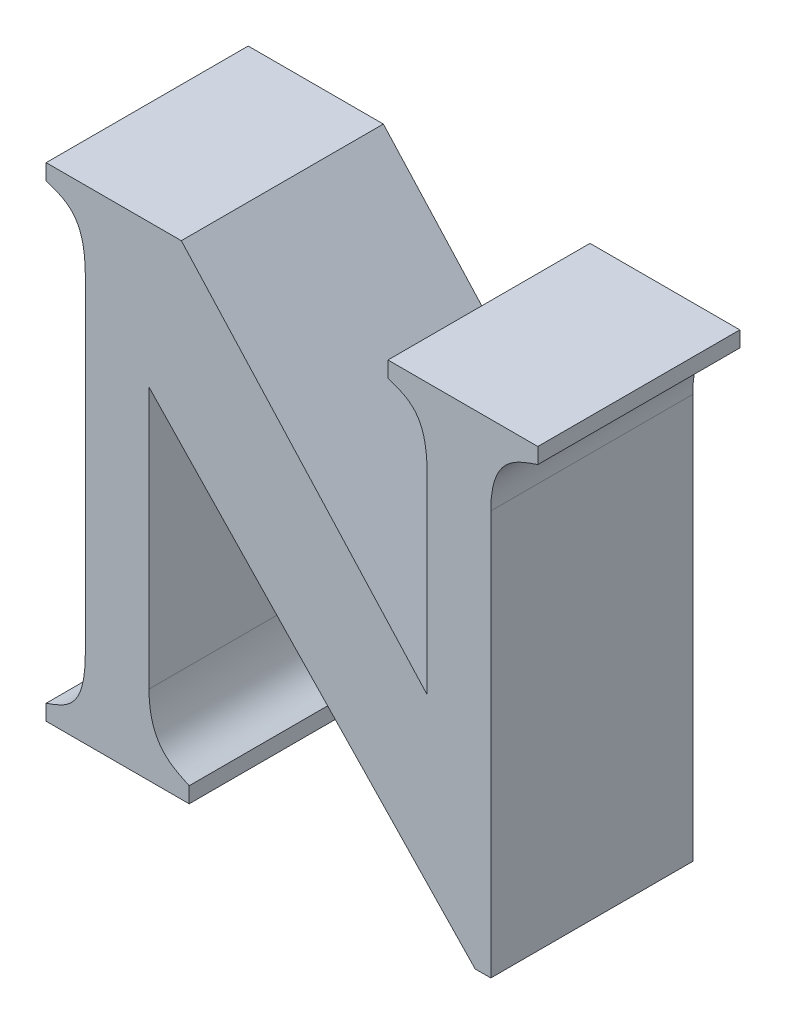
ISO-10303-21;
HEADER;
FILE_DESCRIPTION(('STEP AP214'),'2;1');
FILE_NAME('part.step','',(''),(''),'','','');
FILE_SCHEMA(('AUTOMOTIVE_DESIGN { 1 0 10303 214 1 1 1 1 }'));
ENDSEC;
DATA;
#1=APPLICATION_CONTEXT('core data for automotive mechanical design processes');
#2=APPLICATION_PROTOCOL_DEFINITION('international standard','automotive_design',2000,#1);
#3=PRODUCT_CONTEXT('',#1,'mechanical');
#4=PRODUCT('Part','Part','',(#3));
#5=PRODUCT_RELATED_PRODUCT_CATEGORY('part','',(#4));
#6=PRODUCT_DEFINITION_FORMATION('','',#4);
#7=PRODUCT_DEFINITION_CONTEXT('part definition',#1,'design');
#8=PRODUCT_DEFINITION('design','',#6,#7);
#9=PRODUCT_DEFINITION_SHAPE('','',#8);
#10=(LENGTH_UNIT() NAMED_UNIT(*) SI_UNIT(.MILLI.,.METRE.));
#11=(NAMED_UNIT(*) PLANE_ANGLE_UNIT() SI_UNIT($,.RADIAN.));
#12=(NAMED_UNIT(*) SI_UNIT($,.STERADIAN.) SOLID_ANGLE_UNIT());
#13=UNCERTAINTY_MEASURE_WITH_UNIT(LENGTH_MEASURE(1.E-05),#10,'distance_accuracy_value','');
#14=(GEOMETRIC_REPRESENTATION_CONTEXT(3) GLOBAL_UNCERTAINTY_ASSIGNED_CONTEXT((#13)) GLOBAL_UNIT_ASSIGNED_CONTEXT((#10,
#11,#12)) REPRESENTATION_CONTEXT('',''));
#15=CARTESIAN_POINT('',(0.,0.,0.));
#16=DIRECTION('',(0.,0.,1.));
#17=DIRECTION('',(1.,0.,0.));
#18=AXIS2_PLACEMENT_3D('',#15,#16,#17);
#19=CARTESIAN_POINT('',(2.5314200484986,-0.432050714249068,0.));
#20=DIRECTION('',(1.,0.,0.));
#21=DIRECTION('',(0.,1.,0.));
#22=AXIS2_PLACEMENT_3D('',#19,#20,#21);
#23=PLANE('',#22);
#24=DIRECTION('',(0.,-1.,0.));
#25=VECTOR('',#24,1.);
#26=CARTESIAN_POINT('',(2.5314200484986,-0.231839582517053,0.));
#27=LINE('',#26,#25);
#28=CARTESIAN_POINT('',(2.5314200484986,-0.231839582517053,0.));
#29=VERTEX_POINT('',#28);
#30=CARTESIAN_POINT('',(2.5314200484986,-0.432050714249068,0.));
#31=VERTEX_POINT('',#30);
#32=EDGE_CURVE('E11',#29,#31,#27,.T.);
#33=ORIENTED_EDGE('',*,*,#32,.F.);
#34=DIRECTION('',(0.,0.,1.));
#35=VECTOR('',#34,1.);
#36=CARTESIAN_POINT('',(2.5314200484986,-0.231839582517053,0.));
#37=LINE('',#36,#35);
#38=CARTESIAN_POINT('',(2.5314200484986,-0.231839582517053,0.1));
#39=VERTEX_POINT('',#38);
#40=EDGE_CURVE('E24',#29,#39,#37,.T.);
#41=ORIENTED_EDGE('',*,*,#40,.T.);
#42=DIRECTION('',(0.,1.,0.));
#43=VECTOR('',#42,1.);
#44=CARTESIAN_POINT('',(2.5314200484986,-0.231839582517053,0.1));
#45=LINE('',#44,#43);
#46=CARTESIAN_POINT('',(2.5314200484986,-0.432050714249068,0.1));
#47=VERTEX_POINT('',#46);
#48=EDGE_CURVE('E172',#47,#39,#45,.T.);
#49=ORIENTED_EDGE('',*,*,#48,.F.);
#50=DIRECTION('',(0.,0.,1.));
#51=VECTOR('',#50,1.);
#52=CARTESIAN_POINT('',(2.5314200484986,-0.432050714249068,0.));
#53=LINE('',#52,#51);
#54=EDGE_CURVE('E359',#31,#47,#53,.T.);
#55=ORIENTED_EDGE('',*,*,#54,.F.);
#56=EDGE_LOOP('',(#33,#41,#49,#55));
#57=FACE_BOUND('',#56,.T.);
#58=ADVANCED_FACE('F17',(#57),#23,.T.);
#59=CARTESIAN_POINT('',(2.5236639057569,-0.432050714249068,0.));
#60=DIRECTION('',(0.,-1.,0.));
#61=DIRECTION('',(1.,0.,0.));
#62=AXIS2_PLACEMENT_3D('',#59,#60,#61);
#63=PLANE('',#62);
#64=DIRECTION('',(-1.,0.,0.));
#65=VECTOR('',#64,1.);
#66=CARTESIAN_POINT('',(2.5314200484986,-0.432050714249068,0.));
#67=LINE('',#66,#65);
#68=CARTESIAN_POINT('',(2.5236639057569,-0.432050714249068,0.));
#69=VERTEX_POINT('',#68);
#70=EDGE_CURVE('E357',#31,#69,#67,.T.);
#71=ORIENTED_EDGE('',*,*,#70,.F.);
#72=ORIENTED_EDGE('',*,*,#54,.T.);
#73=DIRECTION('',(1.,0.,0.));
#74=VECTOR('',#73,1.);
#75=CARTESIAN_POINT('',(2.5314200484986,-0.432050714249068,0.1));
#76=LINE('',#75,#74);
#77=CARTESIAN_POINT('',(2.5236639057569,-0.432050714249068,0.1));
#78=VERTEX_POINT('',#77);
#79=EDGE_CURVE('E355',#78,#47,#76,.T.);
#80=ORIENTED_EDGE('',*,*,#79,.F.);
#81=DIRECTION('',(0.,0.,1.));
#82=VECTOR('',#81,1.);
#83=CARTESIAN_POINT('',(2.5236639057569,-0.432050714249068,0.));
#84=LINE('',#83,#82);
#85=EDGE_CURVE('E352',#69,#78,#84,.T.);
#86=ORIENTED_EDGE('',*,*,#85,.F.);
#87=EDGE_LOOP('',(#71,#72,#80,#86));
#88=FACE_BOUND('',#87,.T.);
#89=ADVANCED_FACE('F429',(#88),#63,.T.);
#90=CARTESIAN_POINT('',(2.3622340281803,-0.263349763608539,0.));
#91=DIRECTION('',(-0.722505463033563,-0.691365211654923,0.));
#92=DIRECTION('',(0.691365211654923,-0.722505463033563,0.));
#93=AXIS2_PLACEMENT_3D('',#90,#91,#92);
#94=PLANE('',#93);
#95=DIRECTION('',(-0.691365211654923,0.722505463033563,0.));
#96=VECTOR('',#95,1.);
#97=CARTESIAN_POINT('',(2.5236639057569,-0.432050714249068,0.));
#98=LINE('',#97,#96);
#99=CARTESIAN_POINT('',(2.3622340281803,-0.263349763608539,0.));
#100=VERTEX_POINT('',#99);
#101=EDGE_CURVE('E350',#69,#100,#98,.T.);
#102=ORIENTED_EDGE('',*,*,#101,.F.);
#103=ORIENTED_EDGE('',*,*,#85,.T.);
#104=DIRECTION('',(0.691365211654923,-0.722505463033563,0.));
#105=VECTOR('',#104,1.);
#106=CARTESIAN_POINT('',(2.5236639057569,-0.432050714249068,0.1));
#107=LINE('',#106,#105);
#108=CARTESIAN_POINT('',(2.3622340281803,-0.263349763608539,0.1));
#109=VERTEX_POINT('',#108);
#110=EDGE_CURVE('E347',#109,#78,#107,.T.);
#111=ORIENTED_EDGE('',*,*,#110,.F.);
#112=DIRECTION('',(0.,0.,1.));
#113=VECTOR('',#112,1.);
#114=CARTESIAN_POINT('',(2.3622340281803,-0.263349763608539,0.));
#115=LINE('',#114,#113);
#116=EDGE_CURVE('E344',#100,#109,#115,.T.);
#117=ORIENTED_EDGE('',*,*,#116,.F.);
#118=EDGE_LOOP('',(#102,#103,#111,#117));
#119=FACE_BOUND('',#118,.T.);
#120=ADVANCED_FACE('F425',(#119),#94,.T.);
#121=CARTESIAN_POINT('',(2.3622340281803,-0.392784138206144,0.));
#122=DIRECTION('',(1.,0.,0.));
#123=DIRECTION('',(0.,1.,0.));
#124=AXIS2_PLACEMENT_3D('',#121,#122,#123);
#125=PLANE('',#124);
#126=DIRECTION('',(0.,-1.,0.));
#127=VECTOR('',#126,1.);
#128=CARTESIAN_POINT('',(2.3622340281803,-0.263349763608539,0.));
#129=LINE('',#128,#127);
#130=CARTESIAN_POINT('',(2.3622340281803,-0.392784138206144,0.));
#131=VERTEX_POINT('',#130);
#132=EDGE_CURVE('E342',#100,#131,#129,.T.);
#133=ORIENTED_EDGE('',*,*,#132,.F.);
#134=ORIENTED_EDGE('',*,*,#116,.T.);
#135=DIRECTION('',(0.,1.,0.));
#136=VECTOR('',#135,1.);
#137=CARTESIAN_POINT('',(2.3622340281803,-0.263349763608539,0.1));
#138=LINE('',#137,#136);
#139=CARTESIAN_POINT('',(2.3622340281803,-0.392784138206144,0.1));
#140=VERTEX_POINT('',#139);
#141=EDGE_CURVE('E339',#140,#109,#138,.T.);
#142=ORIENTED_EDGE('',*,*,#141,.F.);
#143=DIRECTION('',(0.,0.,1.));
#144=VECTOR('',#143,1.);
#145=CARTESIAN_POINT('',(2.3622340281803,-0.392784138206144,0.));
#146=LINE('',#145,#144);
#147=EDGE_CURVE('E333',#131,#140,#146,.T.);
#148=ORIENTED_EDGE('',*,*,#147,.F.);
#149=EDGE_LOOP('',(#133,#134,#142,#148));
#150=FACE_BOUND('',#149,.T.);
#151=ADVANCED_FACE('F421',(#150),#125,.T.);
#152=CARTESIAN_POINT('',(2.3821106076673,-0.424294319298148,0.));
#153=CARTESIAN_POINT('',(2.3821106076673,-0.424294319298148,0.1));
#154=CARTESIAN_POINT('',(2.3743544641725,-0.420416068108024,0.));
#155=CARTESIAN_POINT('',(2.3743544641725,-0.420416068108024,0.1));
#156=CARTESIAN_POINT('',(2.3622340275333,-0.416537924348325,0.));
#157=CARTESIAN_POINT('',(2.3622340275333,-0.416537924348325,0.1));
#158=CARTESIAN_POINT('',(2.3622340281803,-0.392784138206144,0.));
#159=CARTESIAN_POINT('',(2.3622340281803,-0.392784138206144,0.1));
#160=B_SPLINE_SURFACE_WITH_KNOTS('',3,1,((#152,#153),(#154,#155),(#156,#157),(#158,#159)),
.UNSPECIFIED.,.F.,.F.,.F.,(4,4),(2,2),(-1.,0.),(0.,0.01),.UNSPECIFIED.);
#161=CARTESIAN_POINT('',(2.3622340281803,-0.392784138206144,0.));
#162=CARTESIAN_POINT('',(2.3622340275333,-0.416537924348325,0.));
#163=CARTESIAN_POINT('',(2.3743544641725,-0.420416068108024,0.));
#164=CARTESIAN_POINT('',(2.3821106076673,-0.424294319298148,0.));
#165=B_SPLINE_CURVE_WITH_KNOTS('',3,(#161,#162,#163,#164),.UNSPECIFIED.,.F.,.F.,(4,4),(0.,1.),.UNSPECIFIED.);
#166=CARTESIAN_POINT('',(2.3821106076673,-0.424294319298148,0.));
#167=VERTEX_POINT('',#166);
#168=EDGE_CURVE('E326',#131,#167,#165,.T.);
#169=CARTESIAN_POINT('',(2.3821106076673,-0.424294319298148,0.1));
#170=CARTESIAN_POINT('',(2.3743544641725,-0.420416068108024,0.1));
#171=CARTESIAN_POINT('',(2.3622340275333,-0.416537924348325,0.1));
#172=CARTESIAN_POINT('',(2.3622340281803,-0.392784138206144,0.1));
#173=B_SPLINE_CURVE_WITH_KNOTS('',3,(#169,#170,#171,#172),.UNSPECIFIED.,.F.,.F.,(4,4),(-1.,0.),.UNSPECIFIED.);
#174=CARTESIAN_POINT('',(2.3821106076673,-0.424294319298148,0.1));
#175=VERTEX_POINT('',#174);
#176=EDGE_CURVE('E321',#175,#140,#173,.T.);
#177=DIRECTION('',(0.,0.,1.));
#178=VECTOR('',#177,1.);
#179=CARTESIAN_POINT('',(2.3821106076673,-0.424294319298148,0.));
#180=LINE('',#179,#178);
#181=EDGE_CURVE('E318',#167,#175,#180,.T.);
#182=ORIENTED_EDGE('',*,*,#168,.F.);
#183=ORIENTED_EDGE('',*,*,#147,.T.);
#184=ORIENTED_EDGE('',*,*,#176,.F.);
#185=ORIENTED_EDGE('',*,*,#181,.F.);
#186=EDGE_LOOP('',(#182,#183,#184,#185));
#187=FACE_BOUND('',#186,.T.);
#188=ADVANCED_FACE('F417',(#187),#160,.T.);
#189=CARTESIAN_POINT('',(2.3821106076673,-0.432050714249068,0.));
#190=DIRECTION('',(1.,0.,0.));
#191=DIRECTION('',(0.,1.,0.));
#192=AXIS2_PLACEMENT_3D('',#189,#190,#191);
#193=PLANE('',#192);
#194=DIRECTION('',(0.,-1.,0.));
#195=VECTOR('',#194,1.);
#196=CARTESIAN_POINT('',(2.3821106076673,-0.424294319298148,0.));
#197=LINE('',#196,#195);
#198=CARTESIAN_POINT('',(2.3821106076673,-0.432050714249068,0.));
#199=VERTEX_POINT('',#198);
#200=EDGE_CURVE('E316',#167,#199,#197,.T.);
#201=ORIENTED_EDGE('',*,*,#200,.F.);
#202=ORIENTED_EDGE('',*,*,#181,.T.);
#203=DIRECTION('',(0.,1.,0.));
#204=VECTOR('',#203,1.);
#205=CARTESIAN_POINT('',(2.3821106076673,-0.424294319298148,0.1));
#206=LINE('',#205,#204);
#207=CARTESIAN_POINT('',(2.3821106076673,-0.432050714249068,0.1));
#208=VERTEX_POINT('',#207);
#209=EDGE_CURVE('E313',#208,#175,#206,.T.);
#210=ORIENTED_EDGE('',*,*,#209,.F.);
#211=DIRECTION('',(0.,0.,1.));
#212=VECTOR('',#211,1.);
#213=CARTESIAN_POINT('',(2.3821106076673,-0.432050714249068,0.));
#214=LINE('',#213,#212);
#215=EDGE_CURVE('E310',#199,#208,#214,.T.);
#216=ORIENTED_EDGE('',*,*,#215,.F.);
#217=EDGE_LOOP('',(#201,#202,#210,#216));
#218=FACE_BOUND('',#217,.T.);
#219=ADVANCED_FACE('F413',(#218),#193,.T.);
#220=CARTESIAN_POINT('',(2.311332517429,-0.432050714249068,0.));
#221=DIRECTION('',(0.,-1.,0.));
#222=DIRECTION('',(1.,0.,0.));
#223=AXIS2_PLACEMENT_3D('',#220,#221,#222);
#224=PLANE('',#223);
#225=DIRECTION('',(-1.,0.,0.));
#226=VECTOR('',#225,1.);
#227=CARTESIAN_POINT('',(2.3821106076673,-0.432050714249068,0.));
#228=LINE('',#227,#226);
#229=CARTESIAN_POINT('',(2.311332517429,-0.432050714249068,0.));
#230=VERTEX_POINT('',#229);
#231=EDGE_CURVE('E308',#199,#230,#228,.T.);
#232=ORIENTED_EDGE('',*,*,#231,.F.);
#233=ORIENTED_EDGE('',*,*,#215,.T.);
#234=DIRECTION('',(1.,0.,0.));
#235=VECTOR('',#234,1.);
#236=CARTESIAN_POINT('',(2.3821106076673,-0.432050714249068,0.1));
#237=LINE('',#236,#235);
#238=CARTESIAN_POINT('',(2.311332517429,-0.432050714249068,0.1));
#239=VERTEX_POINT('',#238);
#240=EDGE_CURVE('E305',#239,#208,#237,.T.);
#241=ORIENTED_EDGE('',*,*,#240,.F.);
#242=DIRECTION('',(0.,0.,1.));
#243=VECTOR('',#242,1.);
#244=CARTESIAN_POINT('',(2.311332517429,-0.432050714249068,0.));
#245=LINE('',#244,#243);
#246=EDGE_CURVE('E302',#230,#239,#245,.T.);
#247=ORIENTED_EDGE('',*,*,#246,.F.);
#248=EDGE_LOOP('',(#232,#233,#241,#247));
#249=FACE_BOUND('',#248,.T.);
#250=ADVANCED_FACE('F409',(#249),#224,.T.);
#251=CARTESIAN_POINT('',(2.311332517429,-0.424294319298148,0.));
#252=DIRECTION('',(-1.,0.,0.));
#253=DIRECTION('',(0.,-1.,0.));
#254=AXIS2_PLACEMENT_3D('',#251,#252,#253);
#255=PLANE('',#254);
#256=DIRECTION('',(0.,1.,0.));
#257=VECTOR('',#256,1.);
#258=CARTESIAN_POINT('',(2.311332517429,-0.432050714249068,0.));
#259=LINE('',#258,#257);
#260=CARTESIAN_POINT('',(2.311332517429,-0.424294319298148,0.));
#261=VERTEX_POINT('',#260);
#262=EDGE_CURVE('E300',#230,#261,#259,.T.);
#263=ORIENTED_EDGE('',*,*,#262,.F.);
#264=ORIENTED_EDGE('',*,*,#246,.T.);
#265=DIRECTION('',(0.,-1.,0.));
#266=VECTOR('',#265,1.);
#267=CARTESIAN_POINT('',(2.311332517429,-0.432050714249068,0.1));
#268=LINE('',#267,#266);
#269=CARTESIAN_POINT('',(2.311332517429,-0.424294319298148,0.1));
#270=VERTEX_POINT('',#269);
#271=EDGE_CURVE('E297',#270,#239,#268,.T.);
#272=ORIENTED_EDGE('',*,*,#271,.F.);
#273=DIRECTION('',(0.,0.,1.));
#274=VECTOR('',#273,1.);
#275=CARTESIAN_POINT('',(2.311332517429,-0.424294319298148,0.));
#276=LINE('',#275,#274);
#277=EDGE_CURVE('E291',#261,#270,#276,.T.);
#278=ORIENTED_EDGE('',*,*,#277,.F.);
#279=EDGE_LOOP('',(#263,#264,#272,#278));
#280=FACE_BOUND('',#279,.T.);
#281=ADVANCED_FACE('F405',(#280),#255,.T.);
#282=CARTESIAN_POINT('',(2.330723775029,-0.392784138206144,0.));
#283=CARTESIAN_POINT('',(2.330723775029,-0.392784138206144,0.1));
#284=CARTESIAN_POINT('',(2.3307237748656,-0.416537923939684,0.));
#285=CARTESIAN_POINT('',(2.3307237748656,-0.416537923939684,0.1));
#286=CARTESIAN_POINT('',(2.3229676322059,-0.420416067532685,0.));
#287=CARTESIAN_POINT('',(2.3229676322059,-0.420416067532685,0.1));
#288=CARTESIAN_POINT('',(2.311332517429,-0.424294319298148,0.));
#289=CARTESIAN_POINT('',(2.311332517429,-0.424294319298148,0.1));
#290=B_SPLINE_SURFACE_WITH_KNOTS('',3,1,((#282,#283),(#284,#285),(#286,#287),(#288,#289)),
.UNSPECIFIED.,.F.,.F.,.F.,(4,4),(2,2),(-1.,0.),(0.,0.01),.UNSPECIFIED.);
#291=CARTESIAN_POINT('',(2.311332517429,-0.424294319298148,0.));
#292=CARTESIAN_POINT('',(2.3229676322059,-0.420416067532685,0.));
#293=CARTESIAN_POINT('',(2.3307237748656,-0.416537923939684,0.));
#294=CARTESIAN_POINT('',(2.330723775029,-0.392784138206144,0.));
#295=B_SPLINE_CURVE_WITH_KNOTS('',3,(#291,#292,#293,#294),.UNSPECIFIED.,.F.,.F.,(4,4),(0.,1.),.UNSPECIFIED.);
#296=CARTESIAN_POINT('',(2.330723775029,-0.392784138206144,0.));
#297=VERTEX_POINT('',#296);
#298=EDGE_CURVE('E284',#261,#297,#295,.T.);
#299=CARTESIAN_POINT('',(2.330723775029,-0.392784138206144,0.1));
#300=CARTESIAN_POINT('',(2.3307237748656,-0.416537923939684,0.1));
#301=CARTESIAN_POINT('',(2.3229676322059,-0.420416067532685,0.1));
#302=CARTESIAN_POINT('',(2.311332517429,-0.424294319298148,0.1));
#303=B_SPLINE_CURVE_WITH_KNOTS('',3,(#299,#300,#301,#302),.UNSPECIFIED.,.F.,.F.,(4,4),(-1.,0.),.UNSPECIFIED.);
#304=CARTESIAN_POINT('',(2.330723775029,-0.392784138206144,0.1));
#305=VERTEX_POINT('',#304);
#306=EDGE_CURVE('E279',#305,#270,#303,.T.);
#307=DIRECTION('',(0.,0.,1.));
#308=VECTOR('',#307,1.);
#309=CARTESIAN_POINT('',(2.330723775029,-0.392784138206144,0.));
#310=LINE('',#309,#308);
#311=EDGE_CURVE('E276',#297,#305,#310,.T.);
#312=ORIENTED_EDGE('',*,*,#298,.F.);
#313=ORIENTED_EDGE('',*,*,#277,.T.);
#314=ORIENTED_EDGE('',*,*,#306,.F.);
#315=ORIENTED_EDGE('',*,*,#311,.F.);
#316=EDGE_LOOP('',(#312,#313,#314,#315));
#317=FACE_BOUND('',#316,.T.);
#318=ADVANCED_FACE('F401',(#317),#290,.T.);
#319=CARTESIAN_POINT('',(2.330723775029,-0.231839582517053,0.));
#320=DIRECTION('',(-1.,0.,0.));
#321=DIRECTION('',(0.,-1.,0.));
#322=AXIS2_PLACEMENT_3D('',#319,#320,#321);
#323=PLANE('',#322);
#324=DIRECTION('',(0.,1.,0.));
#325=VECTOR('',#324,1.);
#326=CARTESIAN_POINT('',(2.330723775029,-0.392784138206144,0.));
#327=LINE('',#326,#325);
#328=CARTESIAN_POINT('',(2.330723775029,-0.231839582517053,0.));
#329=VERTEX_POINT('',#328);
#330=EDGE_CURVE('E274',#297,#329,#327,.T.);
#331=ORIENTED_EDGE('',*,*,#330,.F.);
#332=ORIENTED_EDGE('',*,*,#311,.T.);
#333=DIRECTION('',(0.,-1.,0.));
#334=VECTOR('',#333,1.);
#335=CARTESIAN_POINT('',(2.330723775029,-0.392784138206144,0.1));
#336=LINE('',#335,#334);
#337=CARTESIAN_POINT('',(2.330723775029,-0.231839582517053,0.1));
#338=VERTEX_POINT('',#337);
#339=EDGE_CURVE('E271',#338,#305,#336,.T.);
#340=ORIENTED_EDGE('',*,*,#339,.F.);
#341=DIRECTION('',(0.,0.,1.));
#342=VECTOR('',#341,1.);
#343=CARTESIAN_POINT('',(2.330723775029,-0.231839582517053,0.));
#344=LINE('',#343,#342);
#345=EDGE_CURVE('E265',#329,#338,#344,.T.);
#346=ORIENTED_EDGE('',*,*,#345,.F.);
#347=EDGE_LOOP('',(#331,#332,#340,#346));
#348=FACE_BOUND('',#347,.T.);
#349=ADVANCED_FACE('F397',(#348),#323,.T.);
#350=CARTESIAN_POINT('',(2.311332517429,-0.200329401425036,0.));
#351=CARTESIAN_POINT('',(2.311332517429,-0.200329401425036,0.1));
#352=CARTESIAN_POINT('',(2.3229676322875,-0.204207508825576,0.));
#353=CARTESIAN_POINT('',(2.3229676322875,-0.204207508825576,0.1));
#354=CARTESIAN_POINT('',(2.3307237750288,-0.2080857603454,0.));
#355=CARTESIAN_POINT('',(2.3307237750288,-0.2080857603454,0.1));
#356=CARTESIAN_POINT('',(2.330723775029,-0.231839582517053,0.));
#357=CARTESIAN_POINT('',(2.330723775029,-0.231839582517053,0.1));
#358=B_SPLINE_SURFACE_WITH_KNOTS('',3,1,((#350,#351),(#352,#353),(#354,#355),(#356,#357)),
.UNSPECIFIED.,.F.,.F.,.F.,(4,4),(2,2),(-1.,0.),(0.,0.01),.UNSPECIFIED.);
#359=CARTESIAN_POINT('',(2.330723775029,-0.231839582517053,0.));
#360=CARTESIAN_POINT('',(2.3307237750288,-0.2080857603454,0.));
#361=CARTESIAN_POINT('',(2.3229676322875,-0.204207508825576,0.));
#362=CARTESIAN_POINT('',(2.311332517429,-0.200329401425036,0.));
#363=B_SPLINE_CURVE_WITH_KNOTS('',3,(#359,#360,#361,#362),.UNSPECIFIED.,.F.,.F.,(4,4),(0.,1.),.UNSPECIFIED.);
#364=CARTESIAN_POINT('',(2.311332517429,-0.200329401425036,0.));
#365=VERTEX_POINT('',#364);
#366=EDGE_CURVE('E258',#329,#365,#363,.T.);
#367=CARTESIAN_POINT('',(2.311332517429,-0.200329401425036,0.1));
#368=CARTESIAN_POINT('',(2.3229676322875,-0.204207508825576,0.1));
#369=CARTESIAN_POINT('',(2.3307237750288,-0.2080857603454,0.1));
#370=CARTESIAN_POINT('',(2.330723775029,-0.231839582517053,0.1));
#371=B_SPLINE_CURVE_WITH_KNOTS('',3,(#367,#368,#369,#370),.UNSPECIFIED.,.F.,.F.,(4,4),(-1.,0.),.UNSPECIFIED.);
#372=CARTESIAN_POINT('',(2.311332517429,-0.200329401425036,0.1));
#373=VERTEX_POINT('',#372);
#374=EDGE_CURVE('E253',#373,#338,#371,.T.);
#375=DIRECTION('',(0.,0.,1.));
#376=VECTOR('',#375,1.);
#377=CARTESIAN_POINT('',(2.311332517429,-0.200329401425036,0.));
#378=LINE('',#377,#376);
#379=EDGE_CURVE('E250',#365,#373,#378,.T.);
#380=ORIENTED_EDGE('',*,*,#366,.F.);
#381=ORIENTED_EDGE('',*,*,#345,.T.);
#382=ORIENTED_EDGE('',*,*,#374,.F.);
#383=ORIENTED_EDGE('',*,*,#379,.F.);
#384=EDGE_LOOP('',(#380,#381,#382,#383));
#385=FACE_BOUND('',#384,.T.);
#386=ADVANCED_FACE('F393',(#385),#358,.T.);
#387=CARTESIAN_POINT('',(2.311332517429,-0.19257300647474,0.));
#388=DIRECTION('',(-1.,0.,0.));
#389=DIRECTION('',(0.,-1.,0.));
#390=AXIS2_PLACEMENT_3D('',#387,#388,#389);
#391=PLANE('',#390);
#392=DIRECTION('',(0.,1.,0.));
#393=VECTOR('',#392,1.);
#394=CARTESIAN_POINT('',(2.311332517429,-0.200329401425036,0.));
#395=LINE('',#394,#393);
#396=CARTESIAN_POINT('',(2.311332517429,-0.19257300647474,0.));
#397=VERTEX_POINT('',#396);
#398=EDGE_CURVE('E248',#365,#397,#395,.T.);
#399=ORIENTED_EDGE('',*,*,#398,.F.);
#400=ORIENTED_EDGE('',*,*,#379,.T.);
#401=DIRECTION('',(0.,-1.,0.));
#402=VECTOR('',#401,1.);
#403=CARTESIAN_POINT('',(2.311332517429,-0.200329401425036,0.1));
#404=LINE('',#403,#402);
#405=CARTESIAN_POINT('',(2.311332517429,-0.19257300647474,0.1));
#406=VERTEX_POINT('',#405);
#407=EDGE_CURVE('E245',#406,#373,#404,.T.);
#408=ORIENTED_EDGE('',*,*,#407,.F.);
#409=DIRECTION('',(0.,0.,1.));
#410=VECTOR('',#409,1.);
#411=CARTESIAN_POINT('',(2.311332517429,-0.19257300647474,0.));
#412=LINE('',#411,#410);
#413=EDGE_CURVE('E242',#397,#406,#412,.T.);
#414=ORIENTED_EDGE('',*,*,#413,.F.);
#415=EDGE_LOOP('',(#399,#400,#408,#414));
#416=FACE_BOUND('',#415,.T.);
#417=ADVANCED_FACE('F389',(#416),#391,.T.);
#418=CARTESIAN_POINT('',(2.3782316355506,-0.19257300647474,0.));
#419=DIRECTION('',(0.,1.,0.));
#420=DIRECTION('',(-1.,0.,0.));
#421=AXIS2_PLACEMENT_3D('',#418,#419,#420);
#422=PLANE('',#421);
#423=DIRECTION('',(1.,0.,0.));
#424=VECTOR('',#423,1.);
#425=CARTESIAN_POINT('',(2.311332517429,-0.19257300647474,0.));
#426=LINE('',#425,#424);
#427=CARTESIAN_POINT('',(2.3782316355506,-0.19257300647474,0.));
#428=VERTEX_POINT('',#427);
#429=EDGE_CURVE('E240',#397,#428,#426,.T.);
#430=ORIENTED_EDGE('',*,*,#429,.F.);
#431=ORIENTED_EDGE('',*,*,#413,.T.);
#432=DIRECTION('',(-1.,0.,0.));
#433=VECTOR('',#432,1.);
#434=CARTESIAN_POINT('',(2.311332517429,-0.19257300647474,0.1));
#435=LINE('',#434,#433);
#436=CARTESIAN_POINT('',(2.3782316355506,-0.19257300647474,0.1));
#437=VERTEX_POINT('',#436);
#438=EDGE_CURVE('E237',#437,#406,#435,.T.);
#439=ORIENTED_EDGE('',*,*,#438,.F.);
#440=DIRECTION('',(0.,0.,1.));
#441=VECTOR('',#440,1.);
#442=CARTESIAN_POINT('',(2.3782316355506,-0.19257300647474,0.));
#443=LINE('',#442,#441);
#444=EDGE_CURVE('E234',#428,#437,#443,.T.);
#445=ORIENTED_EDGE('',*,*,#444,.F.);
#446=EDGE_LOOP('',(#430,#431,#439,#445));
#447=FACE_BOUND('',#446,.T.);
#448=ADVANCED_FACE('F385',(#447),#422,.T.);
#449=CARTESIAN_POINT('',(2.4999097953473,-0.326370269912293,0.));
#450=DIRECTION('',(0.739818183486614,0.672806848495589,0.));
#451=DIRECTION('',(-0.672806848495589,0.739818183486614,0.));
#452=AXIS2_PLACEMENT_3D('',#449,#450,#451);
#453=PLANE('',#452);
#454=DIRECTION('',(0.672806848495589,-0.739818183486615,0.));
#455=VECTOR('',#454,1.);
#456=CARTESIAN_POINT('',(2.3782316355506,-0.19257300647474,0.));
#457=LINE('',#456,#455);
#458=CARTESIAN_POINT('',(2.4999097953473,-0.326370269912293,0.));
#459=VERTEX_POINT('',#458);
#460=EDGE_CURVE('E232',#428,#459,#457,.T.);
#461=ORIENTED_EDGE('',*,*,#460,.F.);
#462=ORIENTED_EDGE('',*,*,#444,.T.);
#463=DIRECTION('',(-0.672806848495589,0.739818183486615,0.));
#464=VECTOR('',#463,1.);
#465=CARTESIAN_POINT('',(2.3782316355506,-0.19257300647474,0.1));
#466=LINE('',#465,#464);
#467=CARTESIAN_POINT('',(2.4999097953473,-0.326370269912293,0.1));
#468=VERTEX_POINT('',#467);
#469=EDGE_CURVE('E229',#468,#437,#466,.T.);
#470=ORIENTED_EDGE('',*,*,#469,.F.);
#471=DIRECTION('',(0.,0.,1.));
#472=VECTOR('',#471,1.);
#473=CARTESIAN_POINT('',(2.4999097953473,-0.326370269912293,0.));
#474=LINE('',#473,#472);
#475=EDGE_CURVE('E226',#459,#468,#474,.T.);
#476=ORIENTED_EDGE('',*,*,#475,.F.);
#477=EDGE_LOOP('',(#461,#462,#470,#476));
#478=FACE_BOUND('',#477,.T.);
#479=ADVANCED_FACE('F381',(#478),#453,.T.);
#480=CARTESIAN_POINT('',(2.4999097953473,-0.231839582517053,0.));
#481=DIRECTION('',(-1.,0.,0.));
#482=DIRECTION('',(0.,-1.,0.));
#483=AXIS2_PLACEMENT_3D('',#480,#481,#482);
#484=PLANE('',#483);
#485=DIRECTION('',(0.,1.,0.));
#486=VECTOR('',#485,1.);
#487=CARTESIAN_POINT('',(2.4999097953473,-0.326370269912293,0.));
#488=LINE('',#487,#486);
#489=CARTESIAN_POINT('',(2.4999097953473,-0.231839582517053,0.));
#490=VERTEX_POINT('',#489);
#491=EDGE_CURVE('E224',#459,#490,#488,.T.);
#492=ORIENTED_EDGE('',*,*,#491,.F.);
#493=ORIENTED_EDGE('',*,*,#475,.T.);
#494=DIRECTION('',(0.,-1.,0.));
#495=VECTOR('',#494,1.);
#496=CARTESIAN_POINT('',(2.4999097953473,-0.326370269912293,0.1));
#497=LINE('',#496,#495);
#498=CARTESIAN_POINT('',(2.4999097953473,-0.231839582517053,0.1));
#499=VERTEX_POINT('',#498);
#500=EDGE_CURVE('E221',#499,#468,#497,.T.);
#501=ORIENTED_EDGE('',*,*,#500,.F.);
#502=DIRECTION('',(0.,0.,1.));
#503=VECTOR('',#502,1.);
#504=CARTESIAN_POINT('',(2.4999097953473,-0.231839582517053,0.));
#505=LINE('',#504,#503);
#506=EDGE_CURVE('E215',#490,#499,#505,.T.);
#507=ORIENTED_EDGE('',*,*,#506,.F.);
#508=EDGE_LOOP('',(#492,#493,#501,#507));
#509=FACE_BOUND('',#508,.T.);
#510=ADVANCED_FACE('F377',(#509),#484,.T.);
#511=CARTESIAN_POINT('',(2.4805185377473,-0.200329401425036,0.));
#512=CARTESIAN_POINT('',(2.4805185377473,-0.200329401425036,0.1));
#513=CARTESIAN_POINT('',(2.4921536526059,-0.204207508825576,0.));
#514=CARTESIAN_POINT('',(2.4921536526059,-0.204207508825576,0.1));
#515=CARTESIAN_POINT('',(2.4999097953472,-0.208085760345401,0.));
#516=CARTESIAN_POINT('',(2.4999097953472,-0.208085760345401,0.1));
#517=CARTESIAN_POINT('',(2.4999097953473,-0.231839582517053,0.));
#518=CARTESIAN_POINT('',(2.4999097953473,-0.231839582517053,0.1));
#519=B_SPLINE_SURFACE_WITH_KNOTS('',3,1,((#511,#512),(#513,#514),(#515,#516),(#517,#518)),
.UNSPECIFIED.,.F.,.F.,.F.,(4,4),(2,2),(-1.,0.),(0.,0.01),.UNSPECIFIED.);
#520=CARTESIAN_POINT('',(2.4999097953473,-0.231839582517053,0.));
#521=CARTESIAN_POINT('',(2.4999097953472,-0.208085760345401,0.));
#522=CARTESIAN_POINT('',(2.4921536526059,-0.204207508825576,0.));
#523=CARTESIAN_POINT('',(2.4805185377473,-0.200329401425036,0.));
#524=B_SPLINE_CURVE_WITH_KNOTS('',3,(#520,#521,#522,#523),.UNSPECIFIED.,.F.,.F.,(4,4),(0.,1.),.UNSPECIFIED.);
#525=CARTESIAN_POINT('',(2.4805185377473,-0.200329401425036,0.));
#526=VERTEX_POINT('',#525);
#527=EDGE_CURVE('E208',#490,#526,#524,.T.);
#528=CARTESIAN_POINT('',(2.4805185377473,-0.200329401425036,0.1));
#529=CARTESIAN_POINT('',(2.4921536526059,-0.204207508825576,0.1));
#530=CARTESIAN_POINT('',(2.4999097953472,-0.208085760345401,0.1));
#531=CARTESIAN_POINT('',(2.4999097953473,-0.231839582517053,0.1));
#532=B_SPLINE_CURVE_WITH_KNOTS('',3,(#528,#529,#530,#531),.UNSPECIFIED.,.F.,.F.,(4,4),(-1.,0.),.UNSPECIFIED.);
#533=CARTESIAN_POINT('',(2.4805185377473,-0.200329401425036,0.1));
#534=VERTEX_POINT('',#533);
#535=EDGE_CURVE('E203',#534,#499,#532,.T.);
#536=DIRECTION('',(0.,0.,1.));
#537=VECTOR('',#536,1.);
#538=CARTESIAN_POINT('',(2.4805185377473,-0.200329401425036,0.));
#539=LINE('',#538,#537);
#540=EDGE_CURVE('E200',#526,#534,#539,.T.);
#541=ORIENTED_EDGE('',*,*,#527,.F.);
#542=ORIENTED_EDGE('',*,*,#506,.T.);
#543=ORIENTED_EDGE('',*,*,#535,.F.);
#544=ORIENTED_EDGE('',*,*,#540,.F.);
#545=EDGE_LOOP('',(#541,#542,#543,#544));
#546=FACE_BOUND('',#545,.T.);
#547=ADVANCED_FACE('F373',(#546),#519,.T.);
#548=CARTESIAN_POINT('',(2.4805185377473,-0.19257300647474,0.));
#549=DIRECTION('',(-1.,0.,0.));
#550=DIRECTION('',(0.,-1.,0.));
#551=AXIS2_PLACEMENT_3D('',#548,#549,#550);
#552=PLANE('',#551);
#553=DIRECTION('',(0.,1.,0.));
#554=VECTOR('',#553,1.);
#555=CARTESIAN_POINT('',(2.4805185377473,-0.200329401425036,0.));
#556=LINE('',#555,#554);
#557=CARTESIAN_POINT('',(2.4805185377473,-0.19257300647474,0.));
#558=VERTEX_POINT('',#557);
#559=EDGE_CURVE('E198',#526,#558,#556,.T.);
#560=ORIENTED_EDGE('',*,*,#559,.F.);
#561=ORIENTED_EDGE('',*,*,#540,.T.);
#562=DIRECTION('',(0.,-1.,0.));
#563=VECTOR('',#562,1.);
#564=CARTESIAN_POINT('',(2.4805185377473,-0.200329401425036,0.1));
#565=LINE('',#564,#563);
#566=CARTESIAN_POINT('',(2.4805185377473,-0.19257300647474,0.1));
#567=VERTEX_POINT('',#566);
#568=EDGE_CURVE('E195',#567,#534,#565,.T.);
#569=ORIENTED_EDGE('',*,*,#568,.F.);
#570=DIRECTION('',(0.,0.,1.));
#571=VECTOR('',#570,1.);
#572=CARTESIAN_POINT('',(2.4805185377473,-0.19257300647474,0.));
#573=LINE('',#572,#571);
#574=EDGE_CURVE('E192',#558,#567,#573,.T.);
#575=ORIENTED_EDGE('',*,*,#574,.F.);
#576=EDGE_LOOP('',(#560,#561,#569,#575));
#577=FACE_BOUND('',#576,.T.);
#578=ADVANCED_FACE('F369',(#577),#552,.T.);
#579=CARTESIAN_POINT('',(2.5546888370212,-0.19257300647474,0.));
#580=DIRECTION('',(0.,1.,0.));
#581=DIRECTION('',(-1.,0.,0.));
#582=AXIS2_PLACEMENT_3D('',#579,#580,#581);
#583=PLANE('',#582);
#584=DIRECTION('',(1.,0.,0.));
#585=VECTOR('',#584,1.);
#586=CARTESIAN_POINT('',(2.4805185377473,-0.19257300647474,0.));
#587=LINE('',#586,#585);
#588=CARTESIAN_POINT('',(2.5546888370212,-0.19257300647474,0.));
#589=VERTEX_POINT('',#588);
#590=EDGE_CURVE('E190',#558,#589,#587,.T.);
#591=ORIENTED_EDGE('',*,*,#590,.F.);
#592=ORIENTED_EDGE('',*,*,#574,.T.);
#593=DIRECTION('',(-1.,0.,0.));
#594=VECTOR('',#593,1.);
#595=CARTESIAN_POINT('',(2.4805185377473,-0.19257300647474,0.1));
#596=LINE('',#595,#594);
#597=CARTESIAN_POINT('',(2.5546888370212,-0.19257300647474,0.1));
#598=VERTEX_POINT('',#597);
#599=EDGE_CURVE('E188',#598,#567,#596,.T.);
#600=ORIENTED_EDGE('',*,*,#599,.F.);
#601=DIRECTION('',(0.,0.,1.));
#602=VECTOR('',#601,1.);
#603=CARTESIAN_POINT('',(2.5546888370212,-0.19257300647474,0.));
#604=LINE('',#603,#602);
#605=EDGE_CURVE('E157',#589,#598,#604,.T.);
#606=ORIENTED_EDGE('',*,*,#605,.F.);
#607=EDGE_LOOP('',(#591,#592,#600,#606));
#608=FACE_BOUND('',#607,.T.);
#609=ADVANCED_FACE('F367',(#608),#583,.T.);
#610=CARTESIAN_POINT('',(2.5546888370212,-0.200329401425036,0.));
#611=DIRECTION('',(1.,0.,0.));
#612=DIRECTION('',(0.,1.,0.));
#613=AXIS2_PLACEMENT_3D('',#610,#611,#612);
#614=PLANE('',#613);
#615=DIRECTION('',(0.,-1.,0.));
#616=VECTOR('',#615,1.);
#617=CARTESIAN_POINT('',(2.5546888370212,-0.19257300647474,0.));
#618=LINE('',#617,#616);
#619=CARTESIAN_POINT('',(2.5546888370212,-0.200329401425036,0.));
#620=VERTEX_POINT('',#619);
#621=EDGE_CURVE('E161',#589,#620,#618,.T.);
#622=ORIENTED_EDGE('',*,*,#621,.F.);
#623=ORIENTED_EDGE('',*,*,#605,.T.);
#624=DIRECTION('',(0.,1.,0.));
#625=VECTOR('',#624,1.);
#626=CARTESIAN_POINT('',(2.5546888370212,-0.19257300647474,0.1));
#627=LINE('',#626,#625);
#628=CARTESIAN_POINT('',(2.5546888370212,-0.200329401425036,0.1));
#629=VERTEX_POINT('',#628);
#630=EDGE_CURVE('E150',#629,#598,#627,.T.);
#631=ORIENTED_EDGE('',*,*,#630,.F.);
#632=DIRECTION('',(0.,0.,1.));
#633=VECTOR('',#632,1.);
#634=CARTESIAN_POINT('',(2.5546888370212,-0.200329401425036,0.));
#635=LINE('',#634,#633);
#636=EDGE_CURVE('E154',#620,#629,#635,.T.);
#637=ORIENTED_EDGE('',*,*,#636,.F.);
#638=EDGE_LOOP('',(#622,#623,#631,#637));
#639=FACE_BOUND('',#638,.T.);
#640=ADVANCED_FACE('F153',(#639),#614,.T.);
#641=CARTESIAN_POINT('',(2.5314200484986,-0.231839582517053,0.));
#642=CARTESIAN_POINT('',(2.5314200484986,-0.231839582517053,0.1));
#643=CARTESIAN_POINT('',(2.5314200487299,-0.208085761039013,0.));
#644=CARTESIAN_POINT('',(2.5314200487299,-0.208085761039013,0.1));
#645=CARTESIAN_POINT('',(2.5430551634722,-0.204207509172382,0.));
#646=CARTESIAN_POINT('',(2.5430551634722,-0.204207509172382,0.1));
#647=CARTESIAN_POINT('',(2.5546888370212,-0.200329401425036,0.));
#648=CARTESIAN_POINT('',(2.5546888370212,-0.200329401425036,0.1));
#649=B_SPLINE_SURFACE_WITH_KNOTS('',3,1,((#641,#642),(#643,#644),(#645,#646),(#647,#648)),
.UNSPECIFIED.,.F.,.F.,.F.,(4,4),(2,2),(-1.,0.),(0.,0.01),.UNSPECIFIED.);
#650=CARTESIAN_POINT('',(2.5546888370212,-0.200329401425036,0.));
#651=CARTESIAN_POINT('',(2.5430551634722,-0.204207509172382,0.));
#652=CARTESIAN_POINT('',(2.5314200487299,-0.208085761039013,0.));
#653=CARTESIAN_POINT('',(2.5314200484986,-0.231839582517053,0.));
#654=B_SPLINE_CURVE_WITH_KNOTS('',3,(#650,#651,#652,#653),.UNSPECIFIED.,.F.,.F.,(4,4),(0.,1.),.UNSPECIFIED.);
#655=EDGE_CURVE('E167',#620,#29,#654,.T.);
#656=CARTESIAN_POINT('',(2.5314200484986,-0.231839582517053,0.1));
#657=CARTESIAN_POINT('',(2.5314200487299,-0.208085761039013,0.1));
#658=CARTESIAN_POINT('',(2.5430551634722,-0.204207509172382,0.1));
#659=CARTESIAN_POINT('',(2.5546888370212,-0.200329401425036,0.1));
#660=B_SPLINE_CURVE_WITH_KNOTS('',3,(#656,#657,#658,#659),.UNSPECIFIED.,.F.,.F.,(4,4),(-1.,0.),.UNSPECIFIED.);
#661=EDGE_CURVE('E166',#39,#629,#660,.T.);
#662=ORIENTED_EDGE('',*,*,#655,.F.);
#663=ORIENTED_EDGE('',*,*,#636,.T.);
#664=ORIENTED_EDGE('',*,*,#661,.F.);
#665=ORIENTED_EDGE('',*,*,#40,.F.);
#666=EDGE_LOOP('',(#662,#663,#664,#665));
#667=FACE_BOUND('',#666,.T.);
#668=ADVANCED_FACE('F165',(#667),#649,.T.);
#669=CARTESIAN_POINT('',(2.4291822712793,-0.30514664828663,0.));
#670=DIRECTION('',(0.,0.,1.));
#671=DIRECTION('',(1.,0.,0.));
#672=AXIS2_PLACEMENT_3D('',#669,#670,#671);
#673=PLANE('',#672);
#674=ORIENTED_EDGE('',*,*,#655,.T.);
#675=ORIENTED_EDGE('',*,*,#32,.T.);
#676=ORIENTED_EDGE('',*,*,#70,.T.);
#677=ORIENTED_EDGE('',*,*,#101,.T.);
#678=ORIENTED_EDGE('',*,*,#132,.T.);
#679=ORIENTED_EDGE('',*,*,#168,.T.);
#680=ORIENTED_EDGE('',*,*,#200,.T.);
#681=ORIENTED_EDGE('',*,*,#231,.T.);
#682=ORIENTED_EDGE('',*,*,#262,.T.);
#683=ORIENTED_EDGE('',*,*,#298,.T.);
#684=ORIENTED_EDGE('',*,*,#330,.T.);
#685=ORIENTED_EDGE('',*,*,#366,.T.);
#686=ORIENTED_EDGE('',*,*,#398,.T.);
#687=ORIENTED_EDGE('',*,*,#429,.T.);
#688=ORIENTED_EDGE('',*,*,#460,.T.);
#689=ORIENTED_EDGE('',*,*,#491,.T.);
#690=ORIENTED_EDGE('',*,*,#527,.T.);
#691=ORIENTED_EDGE('',*,*,#559,.T.);
#692=ORIENTED_EDGE('',*,*,#590,.T.);
#693=ORIENTED_EDGE('',*,*,#621,.T.);
#694=EDGE_LOOP('',(#674,#675,#676,#677,#678,#679,#680,#681,#682,#683,#684,#685,#686,#687,#688,
#689,#690,#691,#692,#693));
#695=FACE_BOUND('',#694,.T.);
#696=ADVANCED_FACE('F362',(#695),#673,.F.);
#697=CARTESIAN_POINT('',(2.4291822712793,-0.30514664828663,0.1));
#698=DIRECTION('',(0.,0.,1.));
#699=DIRECTION('',(1.,0.,0.));
#700=AXIS2_PLACEMENT_3D('',#697,#698,#699);
#701=PLANE('',#700);
#702=ORIENTED_EDGE('',*,*,#661,.T.);
#703=ORIENTED_EDGE('',*,*,#630,.T.);
#704=ORIENTED_EDGE('',*,*,#599,.T.);
#705=ORIENTED_EDGE('',*,*,#568,.T.);
#706=ORIENTED_EDGE('',*,*,#535,.T.);
#707=ORIENTED_EDGE('',*,*,#500,.T.);
#708=ORIENTED_EDGE('',*,*,#469,.T.);
#709=ORIENTED_EDGE('',*,*,#438,.T.);
#710=ORIENTED_EDGE('',*,*,#407,.T.);
#711=ORIENTED_EDGE('',*,*,#374,.T.);
#712=ORIENTED_EDGE('',*,*,#339,.T.);
#713=ORIENTED_EDGE('',*,*,#306,.T.);
#714=ORIENTED_EDGE('',*,*,#271,.T.);
#715=ORIENTED_EDGE('',*,*,#240,.T.);
#716=ORIENTED_EDGE('',*,*,#209,.T.);
#717=ORIENTED_EDGE('',*,*,#176,.T.);
#718=ORIENTED_EDGE('',*,*,#141,.T.);
#719=ORIENTED_EDGE('',*,*,#110,.T.);
#720=ORIENTED_EDGE('',*,*,#79,.T.);
#721=ORIENTED_EDGE('',*,*,#48,.T.);
#722=EDGE_LOOP('',(#702,#703,#704,#705,#706,#707,#708,#709,#710,#711,#712,#713,#714,#715,#716,
#717,#718,#719,#720,#721));
#723=FACE_BOUND('',#722,.T.);
#724=ADVANCED_FACE('F170',(#723),#701,.T.);
#725=CLOSED_SHELL('',(#58,#89,#120,#151,#188,#219,#250,#281,#318,#349,#386,#417,#448,#479,#510,
#547,#578,#609,#640,#668,#696,#724));
#726=MANIFOLD_SOLID_BREP('B1',#725);
#727=ADVANCED_BREP_SHAPE_REPRESENTATION('',(#18,#726),#14);
#728=SHAPE_DEFINITION_REPRESENTATION(#9,#727);
ENDSEC;
END-ISO-10303-21;
